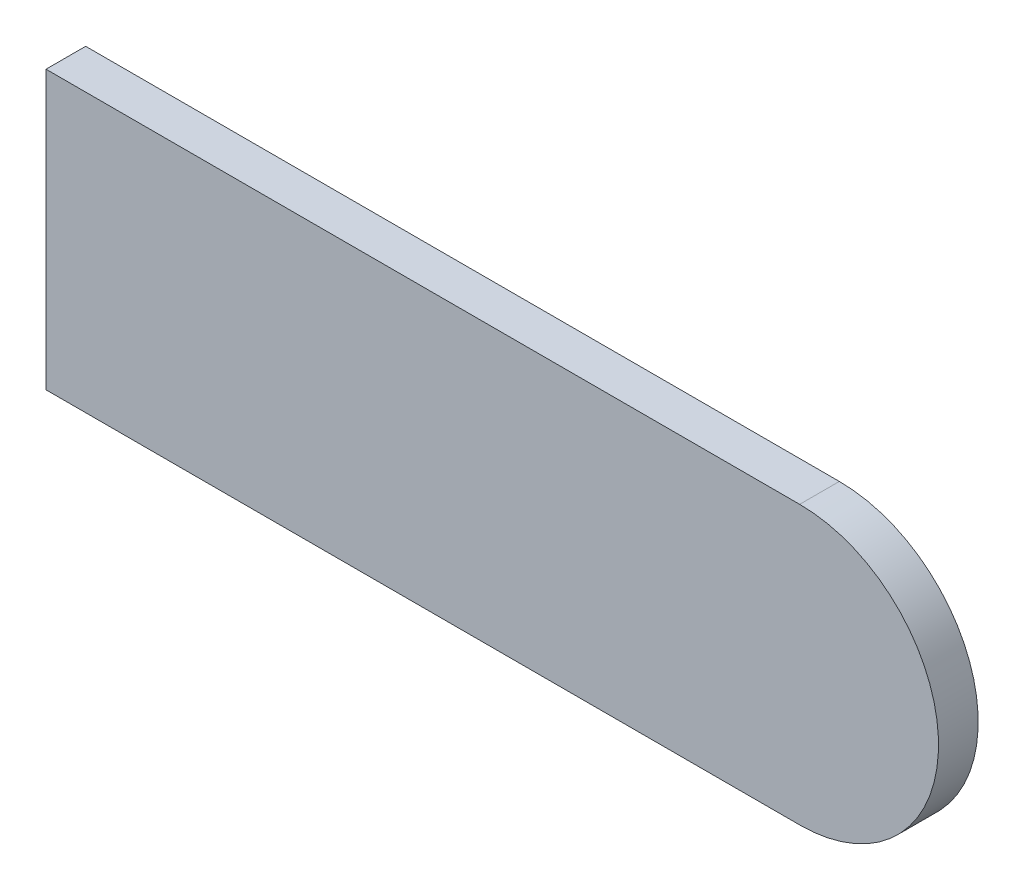
ISO-10303-21;
HEADER;
FILE_DESCRIPTION(('STEP AP214'),'2;1');
FILE_NAME('part.step','',(''),(''),'','','');
FILE_SCHEMA(('AUTOMOTIVE_DESIGN { 1 0 10303 214 1 1 1 1 }'));
ENDSEC;
DATA;
#1=APPLICATION_CONTEXT('core data for automotive mechanical design processes');
#2=APPLICATION_PROTOCOL_DEFINITION('international standard','automotive_design',2000,#1);
#3=PRODUCT_CONTEXT('',#1,'mechanical');
#4=PRODUCT('Part','Part','',(#3));
#5=PRODUCT_RELATED_PRODUCT_CATEGORY('part','',(#4));
#6=PRODUCT_DEFINITION_FORMATION('','',#4);
#7=PRODUCT_DEFINITION_CONTEXT('part definition',#1,'design');
#8=PRODUCT_DEFINITION('design','',#6,#7);
#9=PRODUCT_DEFINITION_SHAPE('','',#8);
#10=(LENGTH_UNIT() NAMED_UNIT(*) SI_UNIT(.MILLI.,.METRE.));
#11=(NAMED_UNIT(*) PLANE_ANGLE_UNIT() SI_UNIT($,.RADIAN.));
#12=(NAMED_UNIT(*) SI_UNIT($,.STERADIAN.) SOLID_ANGLE_UNIT());
#13=UNCERTAINTY_MEASURE_WITH_UNIT(LENGTH_MEASURE(1.E-05),#10,'distance_accuracy_value','');
#14=(GEOMETRIC_REPRESENTATION_CONTEXT(3) GLOBAL_UNCERTAINTY_ASSIGNED_CONTEXT((#13)) GLOBAL_UNIT_ASSIGNED_CONTEXT((#10,
#11,#12)) REPRESENTATION_CONTEXT('',''));
#15=CARTESIAN_POINT('',(0.,0.,0.));
#16=DIRECTION('',(0.,0.,1.));
#17=DIRECTION('',(1.,0.,0.));
#18=AXIS2_PLACEMENT_3D('',#15,#16,#17);
#19=CARTESIAN_POINT('',(1.05723560904739,2.65,0.));
#20=DIRECTION('',(0.,0.,1.));
#21=DIRECTION('',(1.,0.,0.));
#22=AXIS2_PLACEMENT_3D('',#19,#20,#21);
#23=PLANE('',#22);
#24=DIRECTION('',(1.,0.,0.));
#25=VECTOR('',#24,1.);
#26=CARTESIAN_POINT('',(0.,3.,0.));
#27=LINE('',#26,#25);
#28=CARTESIAN_POINT('',(1.9,3.,0.));
#29=VERTEX_POINT('',#28);
#30=CARTESIAN_POINT('',(0.,3.,0.));
#31=VERTEX_POINT('',#30);
#32=EDGE_CURVE('E68',#29,#31,#27,.F.);
#33=ORIENTED_EDGE('',*,*,#32,.F.);
#34=CARTESIAN_POINT('',(1.9,2.65,0.));
#35=DIRECTION('',(0.,0.,-1.));
#36=DIRECTION('',(-1.,0.,0.));
#37=AXIS2_PLACEMENT_3D('',#34,#35,#36);
#38=CIRCLE('',#37,0.35);
#39=CARTESIAN_POINT('',(1.9,2.3,0.));
#40=VERTEX_POINT('',#39);
#41=EDGE_CURVE('E20',#40,#29,#38,.F.);
#42=ORIENTED_EDGE('',*,*,#41,.F.);
#43=DIRECTION('',(1.,0.,0.));
#44=VECTOR('',#43,1.);
#45=CARTESIAN_POINT('',(1.9,2.3,0.));
#46=LINE('',#45,#44);
#47=CARTESIAN_POINT('',(0.,2.3,0.));
#48=VERTEX_POINT('',#47);
#49=EDGE_CURVE('E89',#48,#40,#46,.T.);
#50=ORIENTED_EDGE('',*,*,#49,.F.);
#51=DIRECTION('',(0.,1.,0.));
#52=VECTOR('',#51,1.);
#53=CARTESIAN_POINT('',(0.,2.3,0.));
#54=LINE('',#53,#52);
#55=EDGE_CURVE('E57',#31,#48,#54,.F.);
#56=ORIENTED_EDGE('',*,*,#55,.F.);
#57=EDGE_LOOP('',(#33,#42,#50,#56));
#58=FACE_BOUND('',#57,.T.);
#59=ADVANCED_FACE('F17',(#58),#23,.F.);
#60=CARTESIAN_POINT('',(0.,3.,0.));
#61=DIRECTION('',(0.,1.,0.));
#62=DIRECTION('',(0.,0.,1.));
#63=AXIS2_PLACEMENT_3D('',#60,#61,#62);
#64=PLANE('',#63);
#65=ORIENTED_EDGE('',*,*,#32,.T.);
#66=DIRECTION('',(0.,0.,1.));
#67=VECTOR('',#66,1.);
#68=CARTESIAN_POINT('',(0.,3.,0.));
#69=LINE('',#68,#67);
#70=CARTESIAN_POINT('',(0.,3.,0.1));
#71=VERTEX_POINT('',#70);
#72=EDGE_CURVE('E61',#71,#31,#69,.F.);
#73=ORIENTED_EDGE('',*,*,#72,.F.);
#74=DIRECTION('',(1.,0.,0.));
#75=VECTOR('',#74,1.);
#76=CARTESIAN_POINT('',(1.05723560904739,3.,0.1));
#77=LINE('',#76,#75);
#78=CARTESIAN_POINT('',(1.9,3.,0.1));
#79=VERTEX_POINT('',#78);
#80=EDGE_CURVE('E66',#79,#71,#77,.F.);
#81=ORIENTED_EDGE('',*,*,#80,.F.);
#82=DIRECTION('',(0.,0.,-1.));
#83=VECTOR('',#82,1.);
#84=CARTESIAN_POINT('',(1.9,3.,0.));
#85=LINE('',#84,#83);
#86=EDGE_CURVE('E79',#29,#79,#85,.F.);
#87=ORIENTED_EDGE('',*,*,#86,.F.);
#88=EDGE_LOOP('',(#65,#73,#81,#87));
#89=FACE_BOUND('',#88,.T.);
#90=ADVANCED_FACE('F63',(#89),#64,.T.);
#91=CARTESIAN_POINT('',(0.,2.3,0.));
#92=DIRECTION('',(-1.,0.,0.));
#93=DIRECTION('',(0.,0.,1.));
#94=AXIS2_PLACEMENT_3D('',#91,#92,#93);
#95=PLANE('',#94);
#96=ORIENTED_EDGE('',*,*,#55,.T.);
#97=DIRECTION('',(0.,0.,-1.));
#98=VECTOR('',#97,1.);
#99=CARTESIAN_POINT('',(0.,2.3,0.));
#100=LINE('',#99,#98);
#101=CARTESIAN_POINT('',(0.,2.3,0.1));
#102=VERTEX_POINT('',#101);
#103=EDGE_CURVE('E74',#102,#48,#100,.T.);
#104=ORIENTED_EDGE('',*,*,#103,.F.);
#105=DIRECTION('',(0.,1.,0.));
#106=VECTOR('',#105,1.);
#107=CARTESIAN_POINT('',(0.,2.65,0.1));
#108=LINE('',#107,#106);
#109=EDGE_CURVE('E71',#71,#102,#108,.F.);
#110=ORIENTED_EDGE('',*,*,#109,.F.);
#111=ORIENTED_EDGE('',*,*,#72,.T.);
#112=EDGE_LOOP('',(#96,#104,#110,#111));
#113=FACE_BOUND('',#112,.T.);
#114=ADVANCED_FACE('F72',(#113),#95,.T.);
#115=CARTESIAN_POINT('',(1.9,2.3,0.));
#116=DIRECTION('',(0.,-1.,0.));
#117=DIRECTION('',(0.,0.,-1.));
#118=AXIS2_PLACEMENT_3D('',#115,#116,#117);
#119=PLANE('',#118);
#120=ORIENTED_EDGE('',*,*,#49,.T.);
#121=DIRECTION('',(0.,0.,-1.));
#122=VECTOR('',#121,1.);
#123=CARTESIAN_POINT('',(1.9,2.3,0.));
#124=LINE('',#123,#122);
#125=CARTESIAN_POINT('',(1.9,2.3,0.1));
#126=VERTEX_POINT('',#125);
#127=EDGE_CURVE('E34',#126,#40,#124,.T.);
#128=ORIENTED_EDGE('',*,*,#127,.F.);
#129=DIRECTION('',(1.,0.,0.));
#130=VECTOR('',#129,1.);
#131=CARTESIAN_POINT('',(1.05723560904739,2.3,0.1));
#132=LINE('',#131,#130);
#133=EDGE_CURVE('E26',#102,#126,#132,.T.);
#134=ORIENTED_EDGE('',*,*,#133,.F.);
#135=ORIENTED_EDGE('',*,*,#103,.T.);
#136=EDGE_LOOP('',(#120,#128,#134,#135));
#137=FACE_BOUND('',#136,.T.);
#138=ADVANCED_FACE('F105',(#137),#119,.T.);
#139=CARTESIAN_POINT('',(1.9,2.65,0.));
#140=DIRECTION('',(0.,0.,-1.));
#141=DIRECTION('',(-1.,0.,0.));
#142=AXIS2_PLACEMENT_3D('',#139,#140,#141);
#143=CYLINDRICAL_SURFACE('',#142,0.35);
#144=ORIENTED_EDGE('',*,*,#41,.T.);
#145=ORIENTED_EDGE('',*,*,#86,.T.);
#146=CARTESIAN_POINT('',(1.9,2.65,0.1));
#147=DIRECTION('',(0.,0.,-1.));
#148=DIRECTION('',(-1.,0.,0.));
#149=AXIS2_PLACEMENT_3D('',#146,#147,#148);
#150=CIRCLE('',#149,0.35);
#151=EDGE_CURVE('E11',#126,#79,#150,.F.);
#152=ORIENTED_EDGE('',*,*,#151,.F.);
#153=ORIENTED_EDGE('',*,*,#127,.T.);
#154=EDGE_LOOP('',(#144,#145,#152,#153));
#155=FACE_BOUND('',#154,.T.);
#156=ADVANCED_FACE('F107',(#155),#143,.T.);
#157=CARTESIAN_POINT('',(1.05723560904739,2.65,0.1));
#158=DIRECTION('',(0.,0.,1.));
#159=DIRECTION('',(1.,0.,0.));
#160=AXIS2_PLACEMENT_3D('',#157,#158,#159);
#161=PLANE('',#160);
#162=ORIENTED_EDGE('',*,*,#133,.T.);
#163=ORIENTED_EDGE('',*,*,#151,.T.);
#164=ORIENTED_EDGE('',*,*,#80,.T.);
#165=ORIENTED_EDGE('',*,*,#109,.T.);
#166=EDGE_LOOP('',(#162,#163,#164,#165));
#167=FACE_BOUND('',#166,.T.);
#168=ADVANCED_FACE('F78',(#167),#161,.T.);
#169=CLOSED_SHELL('',(#59,#90,#114,#138,#156,#168));
#170=MANIFOLD_SOLID_BREP('B1',#169);
#171=ADVANCED_BREP_SHAPE_REPRESENTATION('',(#18,#170),#14);
#172=SHAPE_DEFINITION_REPRESENTATION(#9,#171);
ENDSEC;
END-ISO-10303-21;
